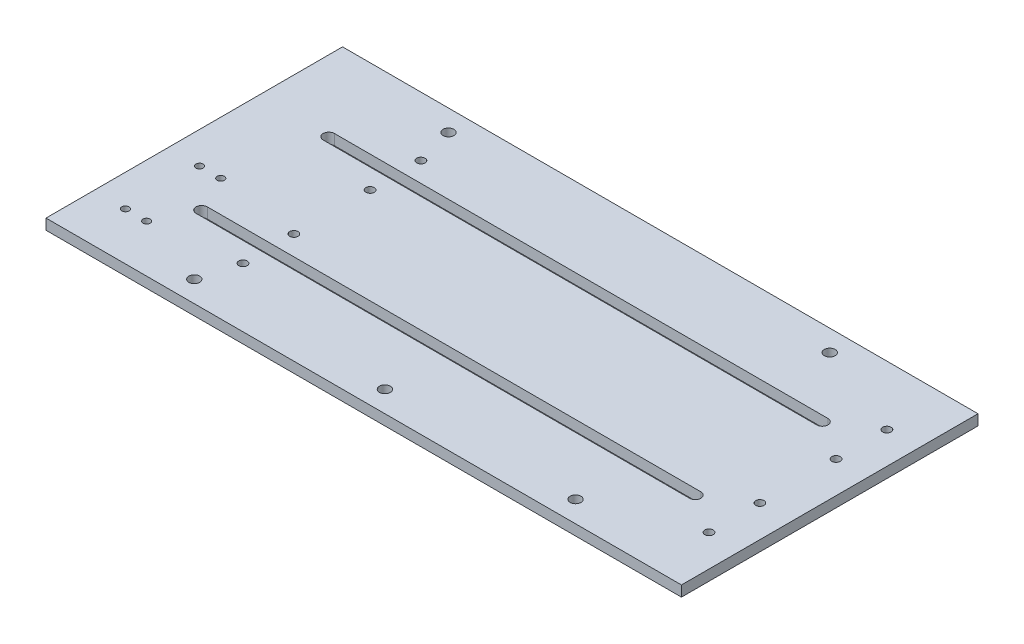
ISO-10303-21;
HEADER;
FILE_DESCRIPTION(('STEP AP214'),'2;1');
FILE_NAME('part.step','',(''),(''),'','','');
FILE_SCHEMA(('AUTOMOTIVE_DESIGN { 1 0 10303 214 1 1 1 1 }'));
ENDSEC;
DATA;
#1=APPLICATION_CONTEXT('core data for automotive mechanical design processes');
#2=APPLICATION_PROTOCOL_DEFINITION('international standard','automotive_design',2000,#1);
#3=PRODUCT_CONTEXT('',#1,'mechanical');
#4=PRODUCT('Part','Part','',(#3));
#5=PRODUCT_RELATED_PRODUCT_CATEGORY('part','',(#4));
#6=PRODUCT_DEFINITION_FORMATION('','',#4);
#7=PRODUCT_DEFINITION_CONTEXT('part definition',#1,'design');
#8=PRODUCT_DEFINITION('design','',#6,#7);
#9=PRODUCT_DEFINITION_SHAPE('','',#8);
#10=(LENGTH_UNIT() NAMED_UNIT(*) SI_UNIT(.MILLI.,.METRE.));
#11=(NAMED_UNIT(*) PLANE_ANGLE_UNIT() SI_UNIT($,.RADIAN.));
#12=(NAMED_UNIT(*) SI_UNIT($,.STERADIAN.) SOLID_ANGLE_UNIT());
#13=UNCERTAINTY_MEASURE_WITH_UNIT(LENGTH_MEASURE(1.E-05),#10,'distance_accuracy_value','');
#14=(GEOMETRIC_REPRESENTATION_CONTEXT(3) GLOBAL_UNCERTAINTY_ASSIGNED_CONTEXT((#13)) GLOBAL_UNIT_ASSIGNED_CONTEXT((#10,
#11,#12)) REPRESENTATION_CONTEXT('',''));
#15=CARTESIAN_POINT('',(0.,0.,0.));
#16=DIRECTION('',(0.,0.,1.));
#17=DIRECTION('',(1.,0.,0.));
#18=AXIS2_PLACEMENT_3D('',#15,#16,#17);
#19=CARTESIAN_POINT('',(-190.5,6.35,88.9));
#20=DIRECTION('',(1.,0.,0.));
#21=DIRECTION('',(0.,0.,-1.));
#22=AXIS2_PLACEMENT_3D('',#19,#20,#21);
#23=PLANE('',#22);
#24=DIRECTION('',(0.,0.,1.));
#25=VECTOR('',#24,1.);
#26=CARTESIAN_POINT('',(-190.5,0.,88.9));
#27=LINE('',#26,#25);
#28=CARTESIAN_POINT('',(-190.5,0.,-88.9));
#29=VERTEX_POINT('',#28);
#30=CARTESIAN_POINT('',(-190.5,0.,88.9));
#31=VERTEX_POINT('',#30);
#32=EDGE_CURVE('E365',#29,#31,#27,.T.);
#33=ORIENTED_EDGE('',*,*,#32,.T.);
#34=DIRECTION('',(0.,-1.,0.));
#35=VECTOR('',#34,1.);
#36=CARTESIAN_POINT('',(-190.5,6.35,88.9));
#37=LINE('',#36,#35);
#38=CARTESIAN_POINT('',(-190.5,6.35,88.9));
#39=VERTEX_POINT('',#38);
#40=EDGE_CURVE('E13',#39,#31,#37,.T.);
#41=ORIENTED_EDGE('',*,*,#40,.F.);
#42=DIRECTION('',(0.,0.,1.));
#43=VECTOR('',#42,1.);
#44=CARTESIAN_POINT('',(-190.5,6.35,88.9));
#45=LINE('',#44,#43);
#46=CARTESIAN_POINT('',(-190.5,6.35,-88.9));
#47=VERTEX_POINT('',#46);
#48=EDGE_CURVE('E366',#47,#39,#45,.T.);
#49=ORIENTED_EDGE('',*,*,#48,.F.);
#50=DIRECTION('',(0.,-1.,0.));
#51=VECTOR('',#50,1.);
#52=CARTESIAN_POINT('',(-190.5,6.35,-88.9));
#53=LINE('',#52,#51);
#54=EDGE_CURVE('E380',#47,#29,#53,.T.);
#55=ORIENTED_EDGE('',*,*,#54,.T.);
#56=EDGE_LOOP('',(#33,#41,#49,#55));
#57=FACE_BOUND('',#56,.T.);
#58=ADVANCED_FACE('F50',(#57),#23,.F.);
#59=CARTESIAN_POINT('',(-190.5,6.35,88.9));
#60=DIRECTION('',(0.,0.,-1.));
#61=DIRECTION('',(-1.,0.,0.));
#62=AXIS2_PLACEMENT_3D('',#59,#60,#61);
#63=PLANE('',#62);
#64=DIRECTION('',(1.,0.,0.));
#65=VECTOR('',#64,1.);
#66=CARTESIAN_POINT('',(-190.5,0.,88.9));
#67=LINE('',#66,#65);
#68=CARTESIAN_POINT('',(190.5,0.,88.9));
#69=VERTEX_POINT('',#68);
#70=EDGE_CURVE('E384',#31,#69,#67,.T.);
#71=ORIENTED_EDGE('',*,*,#70,.T.);
#72=DIRECTION('',(0.,-1.,0.));
#73=VECTOR('',#72,1.);
#74=CARTESIAN_POINT('',(190.5,6.35,88.9));
#75=LINE('',#74,#73);
#76=CARTESIAN_POINT('',(190.5,6.35,88.9));
#77=VERTEX_POINT('',#76);
#78=EDGE_CURVE('E58',#77,#69,#75,.T.);
#79=ORIENTED_EDGE('',*,*,#78,.F.);
#80=DIRECTION('',(1.,0.,0.));
#81=VECTOR('',#80,1.);
#82=CARTESIAN_POINT('',(-190.5,6.35,88.9));
#83=LINE('',#82,#81);
#84=EDGE_CURVE('E370',#39,#77,#83,.T.);
#85=ORIENTED_EDGE('',*,*,#84,.F.);
#86=ORIENTED_EDGE('',*,*,#40,.T.);
#87=EDGE_LOOP('',(#71,#79,#85,#86));
#88=FACE_BOUND('',#87,.T.);
#89=ADVANCED_FACE('F419',(#88),#63,.F.);
#90=CARTESIAN_POINT('',(190.5,6.35,88.9));
#91=DIRECTION('',(-1.,0.,0.));
#92=DIRECTION('',(0.,0.,1.));
#93=AXIS2_PLACEMENT_3D('',#90,#91,#92);
#94=PLANE('',#93);
#95=DIRECTION('',(0.,0.,-1.));
#96=VECTOR('',#95,1.);
#97=CARTESIAN_POINT('',(190.5,0.,88.9));
#98=LINE('',#97,#96);
#99=CARTESIAN_POINT('',(190.5,0.,-88.9));
#100=VERTEX_POINT('',#99);
#101=EDGE_CURVE('E387',#69,#100,#98,.T.);
#102=ORIENTED_EDGE('',*,*,#101,.T.);
#103=DIRECTION('',(0.,-1.,0.));
#104=VECTOR('',#103,1.);
#105=CARTESIAN_POINT('',(190.5,6.35,-88.9));
#106=LINE('',#105,#104);
#107=CARTESIAN_POINT('',(190.5,6.35,-88.9));
#108=VERTEX_POINT('',#107);
#109=EDGE_CURVE('E395',#108,#100,#106,.T.);
#110=ORIENTED_EDGE('',*,*,#109,.F.);
#111=DIRECTION('',(0.,0.,-1.));
#112=VECTOR('',#111,1.);
#113=CARTESIAN_POINT('',(190.5,6.35,88.9));
#114=LINE('',#113,#112);
#115=EDGE_CURVE('E374',#77,#108,#114,.T.);
#116=ORIENTED_EDGE('',*,*,#115,.F.);
#117=ORIENTED_EDGE('',*,*,#78,.T.);
#118=EDGE_LOOP('',(#102,#110,#116,#117));
#119=FACE_BOUND('',#118,.T.);
#120=ADVANCED_FACE('F404',(#119),#94,.F.);
#121=CARTESIAN_POINT('',(-190.5,6.35,-88.9));
#122=DIRECTION('',(0.,0.,1.));
#123=DIRECTION('',(1.,0.,0.));
#124=AXIS2_PLACEMENT_3D('',#121,#122,#123);
#125=PLANE('',#124);
#126=DIRECTION('',(-1.,0.,0.));
#127=VECTOR('',#126,1.);
#128=CARTESIAN_POINT('',(-190.5,0.,-88.9));
#129=LINE('',#128,#127);
#130=EDGE_CURVE('E371',#100,#29,#129,.T.);
#131=ORIENTED_EDGE('',*,*,#130,.T.);
#132=ORIENTED_EDGE('',*,*,#54,.F.);
#133=DIRECTION('',(-1.,0.,0.));
#134=VECTOR('',#133,1.);
#135=CARTESIAN_POINT('',(-190.5,6.35,-88.9));
#136=LINE('',#135,#134);
#137=EDGE_CURVE('E377',#108,#47,#136,.T.);
#138=ORIENTED_EDGE('',*,*,#137,.F.);
#139=ORIENTED_EDGE('',*,*,#109,.T.);
#140=EDGE_LOOP('',(#131,#132,#138,#139));
#141=FACE_BOUND('',#140,.T.);
#142=ADVANCED_FACE('F413',(#141),#125,.F.);
#143=CARTESIAN_POINT('',(0.,6.35,0.));
#144=DIRECTION('',(0.,-1.,0.));
#145=DIRECTION('',(0.,0.,-1.));
#146=AXIS2_PLACEMENT_3D('',#143,#144,#145);
#147=PLANE('',#146);
#148=DIRECTION('',(-1.,0.,0.));
#149=VECTOR('',#148,1.);
#150=CARTESIAN_POINT('',(0.,6.35,-41.4782));
#151=LINE('',#150,#149);
#152=CARTESIAN_POINT('',(147.955,6.35,-41.4782));
#153=VERTEX_POINT('',#152);
#154=CARTESIAN_POINT('',(-147.955,6.35,-41.4782));
#155=VERTEX_POINT('',#154);
#156=EDGE_CURVE('E143',#153,#155,#151,.T.);
#157=ORIENTED_EDGE('',*,*,#156,.F.);
#158=CARTESIAN_POINT('',(147.955,6.35,-38.1));
#159=DIRECTION('',(0.,1.,0.));
#160=DIRECTION('',(0.,0.,-1.));
#161=AXIS2_PLACEMENT_3D('',#158,#159,#160);
#162=CIRCLE('',#161,3.3782);
#163=CARTESIAN_POINT('',(147.955,6.35,-34.7218));
#164=VERTEX_POINT('',#163);
#165=EDGE_CURVE('E136',#164,#153,#162,.T.);
#166=ORIENTED_EDGE('',*,*,#165,.F.);
#167=DIRECTION('',(1.,0.,0.));
#168=VECTOR('',#167,1.);
#169=CARTESIAN_POINT('',(-147.955,6.35,-34.7218));
#170=LINE('',#169,#168);
#171=CARTESIAN_POINT('',(-147.955,6.35,-34.7218));
#172=VERTEX_POINT('',#171);
#173=EDGE_CURVE('E142',#172,#164,#170,.T.);
#174=ORIENTED_EDGE('',*,*,#173,.F.);
#175=CARTESIAN_POINT('',(-147.955,6.35,-38.1));
#176=DIRECTION('',(0.,1.,0.));
#177=DIRECTION('',(0.,0.,-1.));
#178=AXIS2_PLACEMENT_3D('',#175,#176,#177);
#179=CIRCLE('',#178,3.37820000000001);
#180=EDGE_CURVE('E152',#155,#172,#179,.T.);
#181=ORIENTED_EDGE('',*,*,#180,.F.);
#182=EDGE_LOOP('',(#157,#166,#174,#181));
#183=FACE_BOUND('',#182,.T.);
#184=CARTESIAN_POINT('',(147.955,6.35,38.1));
#185=DIRECTION('',(0.,-1.,0.));
#186=DIRECTION('',(0.,0.,1.));
#187=AXIS2_PLACEMENT_3D('',#184,#185,#186);
#188=CIRCLE('',#187,3.3782);
#189=CARTESIAN_POINT('',(147.955,6.35,34.7218));
#190=VERTEX_POINT('',#189);
#191=CARTESIAN_POINT('',(147.955,6.35,41.4782));
#192=VERTEX_POINT('',#191);
#193=EDGE_CURVE('E199',#190,#192,#188,.T.);
#194=ORIENTED_EDGE('',*,*,#193,.T.);
#195=DIRECTION('',(-1.,0.,0.));
#196=VECTOR('',#195,1.);
#197=CARTESIAN_POINT('',(0.,6.35,41.4782));
#198=LINE('',#197,#196);
#199=CARTESIAN_POINT('',(-147.955,6.35,41.4782));
#200=VERTEX_POINT('',#199);
#201=EDGE_CURVE('E186',#192,#200,#198,.T.);
#202=ORIENTED_EDGE('',*,*,#201,.T.);
#203=CARTESIAN_POINT('',(-147.955,6.35,38.1));
#204=DIRECTION('',(0.,-1.,0.));
#205=DIRECTION('',(0.,0.,1.));
#206=AXIS2_PLACEMENT_3D('',#203,#204,#205);
#207=CIRCLE('',#206,3.37820000000001);
#208=CARTESIAN_POINT('',(-147.955,6.35,34.7218));
#209=VERTEX_POINT('',#208);
#210=EDGE_CURVE('E190',#200,#209,#207,.T.);
#211=ORIENTED_EDGE('',*,*,#210,.T.);
#212=DIRECTION('',(1.,0.,0.));
#213=VECTOR('',#212,1.);
#214=CARTESIAN_POINT('',(-147.955,6.35,34.7218));
#215=LINE('',#214,#213);
#216=EDGE_CURVE('E195',#209,#190,#215,.T.);
#217=ORIENTED_EDGE('',*,*,#216,.T.);
#218=EDGE_LOOP('',(#194,#202,#211,#217));
#219=FACE_BOUND('',#218,.T.);
#220=CARTESIAN_POINT('',(-158.75,6.35,60.325));
#221=DIRECTION('',(0.,-1.,0.));
#222=DIRECTION('',(0.,0.,-1.));
#223=AXIS2_PLACEMENT_3D('',#220,#221,#222);
#224=CIRCLE('',#223,2.15265000000001);
#225=CARTESIAN_POINT('',(-158.75,6.35,58.17235));
#226=VERTEX_POINT('',#225);
#227=EDGE_CURVE('E242',#226,#226,#224,.F.);
#228=ORIENTED_EDGE('',*,*,#227,.F.);
#229=EDGE_LOOP('',(#228));
#230=FACE_BOUND('',#229,.T.);
#231=CARTESIAN_POINT('',(-171.45,6.35,15.875));
#232=DIRECTION('',(0.,-1.,0.));
#233=DIRECTION('',(0.,0.,-1.));
#234=AXIS2_PLACEMENT_3D('',#231,#232,#233);
#235=CIRCLE('',#234,2.15265000000001);
#236=CARTESIAN_POINT('',(-171.45,6.35,13.72235));
#237=VERTEX_POINT('',#236);
#238=EDGE_CURVE('E243',#237,#237,#235,.F.);
#239=ORIENTED_EDGE('',*,*,#238,.F.);
#240=EDGE_LOOP('',(#239));
#241=FACE_BOUND('',#240,.T.);
#242=CARTESIAN_POINT('',(-158.75,6.35,15.875));
#243=DIRECTION('',(0.,-1.,0.));
#244=DIRECTION('',(0.,0.,-1.));
#245=AXIS2_PLACEMENT_3D('',#242,#243,#244);
#246=CIRCLE('',#245,2.15265000000001);
#247=CARTESIAN_POINT('',(-158.75,6.35,13.72235));
#248=VERTEX_POINT('',#247);
#249=EDGE_CURVE('E233',#248,#248,#246,.F.);
#250=ORIENTED_EDGE('',*,*,#249,.F.);
#251=EDGE_LOOP('',(#250));
#252=FACE_BOUND('',#251,.T.);
#253=CARTESIAN_POINT('',(-171.45,6.35,60.325));
#254=DIRECTION('',(0.,-1.,0.));
#255=DIRECTION('',(0.,0.,-1.));
#256=AXIS2_PLACEMENT_3D('',#253,#254,#255);
#257=CIRCLE('',#256,2.15265000000001);
#258=CARTESIAN_POINT('',(-171.45,6.35,58.17235));
#259=VERTEX_POINT('',#258);
#260=EDGE_CURVE('E257',#259,#259,#257,.F.);
#261=ORIENTED_EDGE('',*,*,#260,.F.);
#262=EDGE_LOOP('',(#261));
#263=FACE_BOUND('',#262,.T.);
#264=CARTESIAN_POINT('',(-107.95,6.35,-22.86));
#265=DIRECTION('',(0.,-1.,0.));
#266=DIRECTION('',(0.,0.,-1.));
#267=AXIS2_PLACEMENT_3D('',#264,#265,#266);
#268=CIRCLE('',#267,2.5019);
#269=CARTESIAN_POINT('',(-107.95,6.35,-25.3619));
#270=VERTEX_POINT('',#269);
#271=EDGE_CURVE('E291',#270,#270,#268,.F.);
#272=ORIENTED_EDGE('',*,*,#271,.F.);
#273=EDGE_LOOP('',(#272));
#274=FACE_BOUND('',#273,.T.);
#275=CARTESIAN_POINT('',(171.45,6.35,-22.86));
#276=DIRECTION('',(0.,-1.,0.));
#277=DIRECTION('',(0.,0.,-1.));
#278=AXIS2_PLACEMENT_3D('',#275,#276,#277);
#279=CIRCLE('',#278,2.5019);
#280=CARTESIAN_POINT('',(171.45,6.35,-25.3619));
#281=VERTEX_POINT('',#280);
#282=EDGE_CURVE('E290',#281,#281,#279,.F.);
#283=ORIENTED_EDGE('',*,*,#282,.F.);
#284=EDGE_LOOP('',(#283));
#285=FACE_BOUND('',#284,.T.);
#286=CARTESIAN_POINT('',(171.45,6.35,-53.34));
#287=DIRECTION('',(0.,-1.,0.));
#288=DIRECTION('',(0.,0.,-1.));
#289=AXIS2_PLACEMENT_3D('',#286,#287,#288);
#290=CIRCLE('',#289,2.50190000000001);
#291=CARTESIAN_POINT('',(171.45,6.35,-55.8419));
#292=VERTEX_POINT('',#291);
#293=EDGE_CURVE('E307',#292,#292,#290,.F.);
#294=ORIENTED_EDGE('',*,*,#293,.F.);
#295=EDGE_LOOP('',(#294));
#296=FACE_BOUND('',#295,.T.);
#297=CARTESIAN_POINT('',(171.45,6.35,53.34));
#298=DIRECTION('',(0.,-1.,0.));
#299=DIRECTION('',(0.,0.,-1.));
#300=AXIS2_PLACEMENT_3D('',#297,#298,#299);
#301=CIRCLE('',#300,2.50190000000001);
#302=CARTESIAN_POINT('',(171.45,6.35,50.8381));
#303=VERTEX_POINT('',#302);
#304=EDGE_CURVE('E306',#303,#303,#301,.F.);
#305=ORIENTED_EDGE('',*,*,#304,.F.);
#306=EDGE_LOOP('',(#305));
#307=FACE_BOUND('',#306,.T.);
#308=CARTESIAN_POINT('',(-107.95,6.35,-53.34));
#309=DIRECTION('',(0.,-1.,0.));
#310=DIRECTION('',(0.,0.,-1.));
#311=AXIS2_PLACEMENT_3D('',#308,#309,#310);
#312=CIRCLE('',#311,2.50190000000001);
#313=CARTESIAN_POINT('',(-107.95,6.35,-55.8419));
#314=VERTEX_POINT('',#313);
#315=EDGE_CURVE('E266',#314,#314,#312,.F.);
#316=ORIENTED_EDGE('',*,*,#315,.F.);
#317=EDGE_LOOP('',(#316));
#318=FACE_BOUND('',#317,.T.);
#319=CARTESIAN_POINT('',(171.45,6.35,22.86));
#320=DIRECTION('',(0.,-1.,0.));
#321=DIRECTION('',(0.,0.,-1.));
#322=AXIS2_PLACEMENT_3D('',#319,#320,#321);
#323=CIRCLE('',#322,2.5019);
#324=CARTESIAN_POINT('',(171.45,6.35,20.3581));
#325=VERTEX_POINT('',#324);
#326=EDGE_CURVE('E267',#325,#325,#323,.F.);
#327=ORIENTED_EDGE('',*,*,#326,.F.);
#328=EDGE_LOOP('',(#327));
#329=FACE_BOUND('',#328,.T.);
#330=CARTESIAN_POINT('',(-107.95,6.35,53.34));
#331=DIRECTION('',(0.,-1.,0.));
#332=DIRECTION('',(0.,0.,-1.));
#333=AXIS2_PLACEMENT_3D('',#330,#331,#332);
#334=CIRCLE('',#333,2.50190000000001);
#335=CARTESIAN_POINT('',(-107.95,6.35,50.8381));
#336=VERTEX_POINT('',#335);
#337=EDGE_CURVE('E276',#336,#336,#334,.F.);
#338=ORIENTED_EDGE('',*,*,#337,.F.);
#339=EDGE_LOOP('',(#338));
#340=FACE_BOUND('',#339,.T.);
#341=CARTESIAN_POINT('',(-107.95,6.35,22.86));
#342=DIRECTION('',(0.,-1.,0.));
#343=DIRECTION('',(0.,0.,-1.));
#344=AXIS2_PLACEMENT_3D('',#341,#342,#343);
#345=CIRCLE('',#344,2.5019);
#346=CARTESIAN_POINT('',(-107.95,6.35,20.3581));
#347=VERTEX_POINT('',#346);
#348=EDGE_CURVE('E321',#347,#347,#345,.F.);
#349=ORIENTED_EDGE('',*,*,#348,.F.);
#350=EDGE_LOOP('',(#349));
#351=FACE_BOUND('',#350,.T.);
#352=CARTESIAN_POINT('',(114.3,6.35,-76.2));
#353=DIRECTION('',(0.,-1.,0.));
#354=DIRECTION('',(0.,0.,-1.));
#355=AXIS2_PLACEMENT_3D('',#352,#353,#354);
#356=CIRCLE('',#355,3.26389999999999);
#357=CARTESIAN_POINT('',(114.3,6.35,-79.4639));
#358=VERTEX_POINT('',#357);
#359=EDGE_CURVE('E348',#358,#358,#356,.F.);
#360=ORIENTED_EDGE('',*,*,#359,.F.);
#361=EDGE_LOOP('',(#360));
#362=FACE_BOUND('',#361,.T.);
#363=CARTESIAN_POINT('',(-114.3,6.35,-76.2));
#364=DIRECTION('',(0.,-1.,0.));
#365=DIRECTION('',(0.,0.,-1.));
#366=AXIS2_PLACEMENT_3D('',#363,#364,#365);
#367=CIRCLE('',#366,3.26389999999999);
#368=CARTESIAN_POINT('',(-114.3,6.35,-79.4639));
#369=VERTEX_POINT('',#368);
#370=EDGE_CURVE('E340',#369,#369,#367,.F.);
#371=ORIENTED_EDGE('',*,*,#370,.F.);
#372=EDGE_LOOP('',(#371));
#373=FACE_BOUND('',#372,.T.);
#374=CARTESIAN_POINT('',(114.3,6.35,76.2));
#375=DIRECTION('',(0.,-1.,0.));
#376=DIRECTION('',(0.,0.,-1.));
#377=AXIS2_PLACEMENT_3D('',#374,#375,#376);
#378=CIRCLE('',#377,3.26389999999999);
#379=CARTESIAN_POINT('',(114.3,6.35,72.9361));
#380=VERTEX_POINT('',#379);
#381=EDGE_CURVE('E331',#380,#380,#378,.F.);
#382=ORIENTED_EDGE('',*,*,#381,.F.);
#383=EDGE_LOOP('',(#382));
#384=FACE_BOUND('',#383,.T.);
#385=CARTESIAN_POINT('',(-114.3,6.35,76.2));
#386=DIRECTION('',(0.,-1.,0.));
#387=DIRECTION('',(0.,0.,-1.));
#388=AXIS2_PLACEMENT_3D('',#385,#386,#387);
#389=CIRCLE('',#388,3.26389999999999);
#390=CARTESIAN_POINT('',(-114.3,6.35,72.9361));
#391=VERTEX_POINT('',#390);
#392=EDGE_CURVE('E330',#391,#391,#389,.F.);
#393=ORIENTED_EDGE('',*,*,#392,.F.);
#394=EDGE_LOOP('',(#393));
#395=FACE_BOUND('',#394,.T.);
#396=CARTESIAN_POINT('',(0.,6.35,76.2));
#397=DIRECTION('',(0.,-1.,0.));
#398=DIRECTION('',(0.,0.,-1.));
#399=AXIS2_PLACEMENT_3D('',#396,#397,#398);
#400=CIRCLE('',#399,3.2639);
#401=CARTESIAN_POINT('',(0.,6.35,72.9361));
#402=VERTEX_POINT('',#401);
#403=EDGE_CURVE('E361',#402,#402,#400,.F.);
#404=ORIENTED_EDGE('',*,*,#403,.F.);
#405=EDGE_LOOP('',(#404));
#406=FACE_BOUND('',#405,.T.);
#407=ORIENTED_EDGE('',*,*,#48,.T.);
#408=ORIENTED_EDGE('',*,*,#84,.T.);
#409=ORIENTED_EDGE('',*,*,#115,.T.);
#410=ORIENTED_EDGE('',*,*,#137,.T.);
#411=EDGE_LOOP('',(#407,#408,#409,#410));
#412=FACE_BOUND('',#411,.T.);
#413=ADVANCED_FACE('F155',(#183,#219,#230,#241,#252,#263,#274,#285,#296,#307,#318,#329,#340,
#351,#362,#373,#384,#395,#406,#412),#147,.F.);
#414=CARTESIAN_POINT('',(0.,0.,0.));
#415=DIRECTION('',(0.,-1.,0.));
#416=DIRECTION('',(0.,0.,-1.));
#417=AXIS2_PLACEMENT_3D('',#414,#415,#416);
#418=PLANE('',#417);
#419=CARTESIAN_POINT('',(147.955,0.,-38.1));
#420=DIRECTION('',(0.,1.,0.));
#421=DIRECTION('',(0.,0.,-1.));
#422=AXIS2_PLACEMENT_3D('',#419,#420,#421);
#423=CIRCLE('',#422,3.3782);
#424=CARTESIAN_POINT('',(147.955,0.,-34.7218));
#425=VERTEX_POINT('',#424);
#426=CARTESIAN_POINT('',(147.955,0.,-41.4782));
#427=VERTEX_POINT('',#426);
#428=EDGE_CURVE('E167',#425,#427,#423,.T.);
#429=ORIENTED_EDGE('',*,*,#428,.T.);
#430=DIRECTION('',(-1.,0.,0.));
#431=VECTOR('',#430,1.);
#432=CARTESIAN_POINT('',(-25.4,0.,-41.4782));
#433=LINE('',#432,#431);
#434=CARTESIAN_POINT('',(-147.955,0.,-41.4782));
#435=VERTEX_POINT('',#434);
#436=EDGE_CURVE('E149',#427,#435,#433,.T.);
#437=ORIENTED_EDGE('',*,*,#436,.T.);
#438=CARTESIAN_POINT('',(-147.955,0.,-38.1));
#439=DIRECTION('',(0.,1.,0.));
#440=DIRECTION('',(0.,0.,-1.));
#441=AXIS2_PLACEMENT_3D('',#438,#439,#440);
#442=CIRCLE('',#441,3.37820000000001);
#443=CARTESIAN_POINT('',(-147.955,0.,-34.7218));
#444=VERTEX_POINT('',#443);
#445=EDGE_CURVE('E160',#435,#444,#442,.T.);
#446=ORIENTED_EDGE('',*,*,#445,.T.);
#447=DIRECTION('',(1.,0.,0.));
#448=VECTOR('',#447,1.);
#449=CARTESIAN_POINT('',(-147.955,0.,-34.7218));
#450=LINE('',#449,#448);
#451=EDGE_CURVE('E170',#444,#425,#450,.T.);
#452=ORIENTED_EDGE('',*,*,#451,.T.);
#453=EDGE_LOOP('',(#429,#437,#446,#452));
#454=FACE_BOUND('',#453,.T.);
#455=DIRECTION('',(-1.,0.,0.));
#456=VECTOR('',#455,1.);
#457=CARTESIAN_POINT('',(0.,0.,41.4782));
#458=LINE('',#457,#456);
#459=CARTESIAN_POINT('',(147.955,0.,41.4782));
#460=VERTEX_POINT('',#459);
#461=CARTESIAN_POINT('',(-147.955,0.,41.4782));
#462=VERTEX_POINT('',#461);
#463=EDGE_CURVE('E191',#460,#462,#458,.T.);
#464=ORIENTED_EDGE('',*,*,#463,.F.);
#465=CARTESIAN_POINT('',(147.955,0.,38.1));
#466=DIRECTION('',(0.,-1.,0.));
#467=DIRECTION('',(0.,0.,1.));
#468=AXIS2_PLACEMENT_3D('',#465,#466,#467);
#469=CIRCLE('',#468,3.3782);
#470=CARTESIAN_POINT('',(147.955,0.,34.7218));
#471=VERTEX_POINT('',#470);
#472=EDGE_CURVE('E211',#471,#460,#469,.T.);
#473=ORIENTED_EDGE('',*,*,#472,.F.);
#474=DIRECTION('',(1.,0.,0.));
#475=VECTOR('',#474,1.);
#476=CARTESIAN_POINT('',(-147.955,0.,34.7218));
#477=LINE('',#476,#475);
#478=CARTESIAN_POINT('',(-147.955,0.,34.7218));
#479=VERTEX_POINT('',#478);
#480=EDGE_CURVE('E207',#479,#471,#477,.T.);
#481=ORIENTED_EDGE('',*,*,#480,.F.);
#482=CARTESIAN_POINT('',(-147.955,0.,38.1));
#483=DIRECTION('',(0.,-1.,0.));
#484=DIRECTION('',(0.,0.,1.));
#485=AXIS2_PLACEMENT_3D('',#482,#483,#484);
#486=CIRCLE('',#485,3.37820000000001);
#487=EDGE_CURVE('E180',#462,#479,#486,.T.);
#488=ORIENTED_EDGE('',*,*,#487,.F.);
#489=EDGE_LOOP('',(#464,#473,#481,#488));
#490=FACE_BOUND('',#489,.T.);
#491=CARTESIAN_POINT('',(-158.75,0.,60.325));
#492=DIRECTION('',(0.,-1.,0.));
#493=DIRECTION('',(0.,0.,-1.));
#494=AXIS2_PLACEMENT_3D('',#491,#492,#493);
#495=CIRCLE('',#494,2.15265000000001);
#496=CARTESIAN_POINT('',(-158.75,0.,58.17235));
#497=VERTEX_POINT('',#496);
#498=EDGE_CURVE('E238',#497,#497,#495,.T.);
#499=ORIENTED_EDGE('',*,*,#498,.F.);
#500=EDGE_LOOP('',(#499));
#501=FACE_BOUND('',#500,.T.);
#502=CARTESIAN_POINT('',(-171.45,0.,15.875));
#503=DIRECTION('',(0.,-1.,0.));
#504=DIRECTION('',(0.,0.,-1.));
#505=AXIS2_PLACEMENT_3D('',#502,#503,#504);
#506=CIRCLE('',#505,2.15265000000001);
#507=CARTESIAN_POINT('',(-171.45,0.,13.72235));
#508=VERTEX_POINT('',#507);
#509=EDGE_CURVE('E237',#508,#508,#506,.T.);
#510=ORIENTED_EDGE('',*,*,#509,.F.);
#511=EDGE_LOOP('',(#510));
#512=FACE_BOUND('',#511,.T.);
#513=CARTESIAN_POINT('',(-158.75,0.,15.875));
#514=DIRECTION('',(0.,-1.,0.));
#515=DIRECTION('',(0.,0.,-1.));
#516=AXIS2_PLACEMENT_3D('',#513,#514,#515);
#517=CIRCLE('',#516,2.15265000000001);
#518=CARTESIAN_POINT('',(-158.75,0.,13.72235));
#519=VERTEX_POINT('',#518);
#520=EDGE_CURVE('E221',#519,#519,#517,.T.);
#521=ORIENTED_EDGE('',*,*,#520,.F.);
#522=EDGE_LOOP('',(#521));
#523=FACE_BOUND('',#522,.T.);
#524=CARTESIAN_POINT('',(-171.45,0.,60.325));
#525=DIRECTION('',(0.,-1.,0.));
#526=DIRECTION('',(0.,0.,-1.));
#527=AXIS2_PLACEMENT_3D('',#524,#525,#526);
#528=CIRCLE('',#527,2.15265000000001);
#529=CARTESIAN_POINT('',(-171.45,0.,58.17235));
#530=VERTEX_POINT('',#529);
#531=EDGE_CURVE('E247',#530,#530,#528,.T.);
#532=ORIENTED_EDGE('',*,*,#531,.F.);
#533=EDGE_LOOP('',(#532));
#534=FACE_BOUND('',#533,.T.);
#535=CARTESIAN_POINT('',(-107.95,0.,-22.86));
#536=DIRECTION('',(0.,-1.,0.));
#537=DIRECTION('',(0.,0.,1.));
#538=AXIS2_PLACEMENT_3D('',#535,#536,#537);
#539=CIRCLE('',#538,2.5019);
#540=CARTESIAN_POINT('',(-107.95,0.,-20.3581));
#541=VERTEX_POINT('',#540);
#542=EDGE_CURVE('E271',#541,#541,#539,.T.);
#543=ORIENTED_EDGE('',*,*,#542,.F.);
#544=EDGE_LOOP('',(#543));
#545=FACE_BOUND('',#544,.T.);
#546=CARTESIAN_POINT('',(171.45,0.,-22.86));
#547=DIRECTION('',(0.,-1.,0.));
#548=DIRECTION('',(0.,0.,1.));
#549=AXIS2_PLACEMENT_3D('',#546,#547,#548);
#550=CIRCLE('',#549,2.5019);
#551=CARTESIAN_POINT('',(171.45,0.,-20.3581));
#552=VERTEX_POINT('',#551);
#553=EDGE_CURVE('E286',#552,#552,#550,.T.);
#554=ORIENTED_EDGE('',*,*,#553,.F.);
#555=EDGE_LOOP('',(#554));
#556=FACE_BOUND('',#555,.T.);
#557=CARTESIAN_POINT('',(171.45,0.,-53.34));
#558=DIRECTION('',(0.,-1.,0.));
#559=DIRECTION('',(0.,0.,1.));
#560=AXIS2_PLACEMENT_3D('',#557,#558,#559);
#561=CIRCLE('',#560,2.50190000000001);
#562=CARTESIAN_POINT('',(171.45,0.,-50.8381));
#563=VERTEX_POINT('',#562);
#564=EDGE_CURVE('E295',#563,#563,#561,.T.);
#565=ORIENTED_EDGE('',*,*,#564,.F.);
#566=EDGE_LOOP('',(#565));
#567=FACE_BOUND('',#566,.T.);
#568=CARTESIAN_POINT('',(171.45,0.,53.34));
#569=DIRECTION('',(0.,-1.,0.));
#570=DIRECTION('',(0.,0.,-1.));
#571=AXIS2_PLACEMENT_3D('',#568,#569,#570);
#572=CIRCLE('',#571,2.50190000000001);
#573=CARTESIAN_POINT('',(171.45,0.,50.8381));
#574=VERTEX_POINT('',#573);
#575=EDGE_CURVE('E302',#574,#574,#572,.T.);
#576=ORIENTED_EDGE('',*,*,#575,.F.);
#577=EDGE_LOOP('',(#576));
#578=FACE_BOUND('',#577,.T.);
#579=CARTESIAN_POINT('',(-107.95,0.,-53.34));
#580=DIRECTION('',(0.,-1.,0.));
#581=DIRECTION('',(0.,0.,-1.));
#582=AXIS2_PLACEMENT_3D('',#579,#580,#581);
#583=CIRCLE('',#582,2.50190000000001);
#584=CARTESIAN_POINT('',(-107.95,0.,-55.8419));
#585=VERTEX_POINT('',#584);
#586=EDGE_CURVE('E262',#585,#585,#583,.T.);
#587=ORIENTED_EDGE('',*,*,#586,.F.);
#588=EDGE_LOOP('',(#587));
#589=FACE_BOUND('',#588,.T.);
#590=CARTESIAN_POINT('',(171.45,0.,22.86));
#591=DIRECTION('',(0.,-1.,0.));
#592=DIRECTION('',(0.,0.,-1.));
#593=AXIS2_PLACEMENT_3D('',#590,#591,#592);
#594=CIRCLE('',#593,2.5019);
#595=CARTESIAN_POINT('',(171.45,0.,20.3581));
#596=VERTEX_POINT('',#595);
#597=EDGE_CURVE('E272',#596,#596,#594,.T.);
#598=ORIENTED_EDGE('',*,*,#597,.F.);
#599=EDGE_LOOP('',(#598));
#600=FACE_BOUND('',#599,.T.);
#601=CARTESIAN_POINT('',(-107.95,0.,53.34));
#602=DIRECTION('',(0.,-1.,0.));
#603=DIRECTION('',(0.,0.,1.));
#604=AXIS2_PLACEMENT_3D('',#601,#602,#603);
#605=CIRCLE('',#604,2.50190000000001);
#606=CARTESIAN_POINT('',(-107.95,0.,55.8419));
#607=VERTEX_POINT('',#606);
#608=EDGE_CURVE('E261',#607,#607,#605,.T.);
#609=ORIENTED_EDGE('',*,*,#608,.F.);
#610=EDGE_LOOP('',(#609));
#611=FACE_BOUND('',#610,.T.);
#612=CARTESIAN_POINT('',(-107.95,0.,22.86));
#613=DIRECTION('',(0.,-1.,0.));
#614=DIRECTION('',(0.,0.,-1.));
#615=AXIS2_PLACEMENT_3D('',#612,#613,#614);
#616=CIRCLE('',#615,2.5019);
#617=CARTESIAN_POINT('',(-107.95,0.,20.3581));
#618=VERTEX_POINT('',#617);
#619=EDGE_CURVE('E311',#618,#618,#616,.T.);
#620=ORIENTED_EDGE('',*,*,#619,.F.);
#621=EDGE_LOOP('',(#620));
#622=FACE_BOUND('',#621,.T.);
#623=CARTESIAN_POINT('',(114.3,0.,-76.2));
#624=DIRECTION('',(0.,-1.,0.));
#625=DIRECTION('',(0.,0.,-1.));
#626=AXIS2_PLACEMENT_3D('',#623,#624,#625);
#627=CIRCLE('',#626,3.26389999999999);
#628=CARTESIAN_POINT('',(114.3,0.,-79.4639));
#629=VERTEX_POINT('',#628);
#630=EDGE_CURVE('E325',#629,#629,#627,.T.);
#631=ORIENTED_EDGE('',*,*,#630,.F.);
#632=EDGE_LOOP('',(#631));
#633=FACE_BOUND('',#632,.T.);
#634=CARTESIAN_POINT('',(-114.3,0.,-76.2));
#635=DIRECTION('',(0.,-1.,0.));
#636=DIRECTION('',(0.,0.,-1.));
#637=AXIS2_PLACEMENT_3D('',#634,#635,#636);
#638=CIRCLE('',#637,3.26389999999999);
#639=CARTESIAN_POINT('',(-114.3,0.,-79.4639));
#640=VERTEX_POINT('',#639);
#641=EDGE_CURVE('E344',#640,#640,#638,.T.);
#642=ORIENTED_EDGE('',*,*,#641,.F.);
#643=EDGE_LOOP('',(#642));
#644=FACE_BOUND('',#643,.T.);
#645=CARTESIAN_POINT('',(114.3,0.,76.2));
#646=DIRECTION('',(0.,-1.,0.));
#647=DIRECTION('',(0.,0.,-1.));
#648=AXIS2_PLACEMENT_3D('',#645,#646,#647);
#649=CIRCLE('',#648,3.26389999999999);
#650=CARTESIAN_POINT('',(114.3,0.,72.9361));
#651=VERTEX_POINT('',#650);
#652=EDGE_CURVE('E336',#651,#651,#649,.T.);
#653=ORIENTED_EDGE('',*,*,#652,.F.);
#654=EDGE_LOOP('',(#653));
#655=FACE_BOUND('',#654,.T.);
#656=CARTESIAN_POINT('',(-114.3,0.,76.2));
#657=DIRECTION('',(0.,-1.,0.));
#658=DIRECTION('',(0.,0.,-1.));
#659=AXIS2_PLACEMENT_3D('',#656,#657,#658);
#660=CIRCLE('',#659,3.26389999999999);
#661=CARTESIAN_POINT('',(-114.3,0.,72.9361));
#662=VERTEX_POINT('',#661);
#663=EDGE_CURVE('E326',#662,#662,#660,.T.);
#664=ORIENTED_EDGE('',*,*,#663,.F.);
#665=EDGE_LOOP('',(#664));
#666=FACE_BOUND('',#665,.T.);
#667=CARTESIAN_POINT('',(0.,0.,76.2));
#668=DIRECTION('',(0.,-1.,0.));
#669=DIRECTION('',(0.,0.,-1.));
#670=AXIS2_PLACEMENT_3D('',#667,#668,#669);
#671=CIRCLE('',#670,3.2639);
#672=CARTESIAN_POINT('',(0.,0.,72.9361));
#673=VERTEX_POINT('',#672);
#674=EDGE_CURVE('E335',#673,#673,#671,.T.);
#675=ORIENTED_EDGE('',*,*,#674,.F.);
#676=EDGE_LOOP('',(#675));
#677=FACE_BOUND('',#676,.T.);
#678=ORIENTED_EDGE('',*,*,#32,.F.);
#679=ORIENTED_EDGE('',*,*,#130,.F.);
#680=ORIENTED_EDGE('',*,*,#101,.F.);
#681=ORIENTED_EDGE('',*,*,#70,.F.);
#682=EDGE_LOOP('',(#678,#679,#680,#681));
#683=FACE_BOUND('',#682,.T.);
#684=ADVANCED_FACE('F410',(#454,#490,#501,#512,#523,#534,#545,#556,#567,#578,#589,#600,#611,
#622,#633,#644,#655,#666,#677,#683),#418,.T.);
#685=CARTESIAN_POINT('',(0.,15.5817032924591,76.2));
#686=DIRECTION('',(0.,-1.,0.));
#687=DIRECTION('',(0.,0.,-1.));
#688=AXIS2_PLACEMENT_3D('',#685,#686,#687);
#689=CYLINDRICAL_SURFACE('',#688,3.2639);
#690=ORIENTED_EDGE('',*,*,#403,.T.);
#691=EDGE_LOOP('',(#690));
#692=FACE_BOUND('',#691,.T.);
#693=ORIENTED_EDGE('',*,*,#674,.T.);
#694=EDGE_LOOP('',(#693));
#695=FACE_BOUND('',#694,.T.);
#696=ADVANCED_FACE('F431',(#692,#695),#689,.F.);
#697=CARTESIAN_POINT('',(-114.3,15.5817032924591,76.2));
#698=DIRECTION('',(0.,-1.,0.));
#699=DIRECTION('',(0.,0.,-1.));
#700=AXIS2_PLACEMENT_3D('',#697,#698,#699);
#701=CYLINDRICAL_SURFACE('',#700,3.26389999999999);
#702=ORIENTED_EDGE('',*,*,#392,.T.);
#703=EDGE_LOOP('',(#702));
#704=FACE_BOUND('',#703,.T.);
#705=ORIENTED_EDGE('',*,*,#663,.T.);
#706=EDGE_LOOP('',(#705));
#707=FACE_BOUND('',#706,.T.);
#708=ADVANCED_FACE('F437',(#704,#707),#701,.F.);
#709=CARTESIAN_POINT('',(114.3,15.5817032924591,76.2));
#710=DIRECTION('',(0.,-1.,0.));
#711=DIRECTION('',(0.,0.,-1.));
#712=AXIS2_PLACEMENT_3D('',#709,#710,#711);
#713=CYLINDRICAL_SURFACE('',#712,3.26389999999999);
#714=ORIENTED_EDGE('',*,*,#381,.T.);
#715=EDGE_LOOP('',(#714));
#716=FACE_BOUND('',#715,.T.);
#717=ORIENTED_EDGE('',*,*,#652,.T.);
#718=EDGE_LOOP('',(#717));
#719=FACE_BOUND('',#718,.T.);
#720=ADVANCED_FACE('F447',(#716,#719),#713,.F.);
#721=CARTESIAN_POINT('',(-114.3,15.5817032924591,-76.2));
#722=DIRECTION('',(0.,-1.,0.));
#723=DIRECTION('',(0.,0.,-1.));
#724=AXIS2_PLACEMENT_3D('',#721,#722,#723);
#725=CYLINDRICAL_SURFACE('',#724,3.26389999999999);
#726=ORIENTED_EDGE('',*,*,#370,.T.);
#727=EDGE_LOOP('',(#726));
#728=FACE_BOUND('',#727,.T.);
#729=ORIENTED_EDGE('',*,*,#641,.T.);
#730=EDGE_LOOP('',(#729));
#731=FACE_BOUND('',#730,.T.);
#732=ADVANCED_FACE('F443',(#728,#731),#725,.F.);
#733=CARTESIAN_POINT('',(114.3,15.5817032924591,-76.2));
#734=DIRECTION('',(0.,-1.,0.));
#735=DIRECTION('',(0.,0.,-1.));
#736=AXIS2_PLACEMENT_3D('',#733,#734,#735);
#737=CYLINDRICAL_SURFACE('',#736,3.26389999999999);
#738=ORIENTED_EDGE('',*,*,#359,.T.);
#739=EDGE_LOOP('',(#738));
#740=FACE_BOUND('',#739,.T.);
#741=ORIENTED_EDGE('',*,*,#630,.T.);
#742=EDGE_LOOP('',(#741));
#743=FACE_BOUND('',#742,.T.);
#744=ADVANCED_FACE('F439',(#740,#743),#737,.F.);
#745=CARTESIAN_POINT('',(-107.95,13.4264418234025,22.86));
#746=DIRECTION('',(0.,-1.,0.));
#747=DIRECTION('',(0.,0.,-1.));
#748=AXIS2_PLACEMENT_3D('',#745,#746,#747);
#749=CYLINDRICAL_SURFACE('',#748,2.5019);
#750=ORIENTED_EDGE('',*,*,#348,.T.);
#751=EDGE_LOOP('',(#750));
#752=FACE_BOUND('',#751,.T.);
#753=ORIENTED_EDGE('',*,*,#619,.T.);
#754=EDGE_LOOP('',(#753));
#755=FACE_BOUND('',#754,.T.);
#756=ADVANCED_FACE('F442',(#752,#755),#749,.F.);
#757=CARTESIAN_POINT('',(-107.95,13.4264418234025,53.34));
#758=DIRECTION('',(0.,-1.,0.));
#759=DIRECTION('',(0.,0.,-1.));
#760=AXIS2_PLACEMENT_3D('',#757,#758,#759);
#761=CYLINDRICAL_SURFACE('',#760,2.50190000000001);
#762=ORIENTED_EDGE('',*,*,#337,.T.);
#763=EDGE_LOOP('',(#762));
#764=FACE_BOUND('',#763,.T.);
#765=ORIENTED_EDGE('',*,*,#608,.T.);
#766=EDGE_LOOP('',(#765));
#767=FACE_BOUND('',#766,.T.);
#768=ADVANCED_FACE('F457',(#764,#767),#761,.F.);
#769=CARTESIAN_POINT('',(171.45,13.4264418234025,22.86));
#770=DIRECTION('',(0.,-1.,0.));
#771=DIRECTION('',(0.,0.,-1.));
#772=AXIS2_PLACEMENT_3D('',#769,#770,#771);
#773=CYLINDRICAL_SURFACE('',#772,2.5019);
#774=ORIENTED_EDGE('',*,*,#326,.T.);
#775=EDGE_LOOP('',(#774));
#776=FACE_BOUND('',#775,.T.);
#777=ORIENTED_EDGE('',*,*,#597,.T.);
#778=EDGE_LOOP('',(#777));
#779=FACE_BOUND('',#778,.T.);
#780=ADVANCED_FACE('F479',(#776,#779),#773,.F.);
#781=CARTESIAN_POINT('',(-107.95,13.4264418234025,-53.34));
#782=DIRECTION('',(0.,-1.,0.));
#783=DIRECTION('',(0.,0.,-1.));
#784=AXIS2_PLACEMENT_3D('',#781,#782,#783);
#785=CYLINDRICAL_SURFACE('',#784,2.50190000000001);
#786=ORIENTED_EDGE('',*,*,#315,.T.);
#787=EDGE_LOOP('',(#786));
#788=FACE_BOUND('',#787,.T.);
#789=ORIENTED_EDGE('',*,*,#586,.T.);
#790=EDGE_LOOP('',(#789));
#791=FACE_BOUND('',#790,.T.);
#792=ADVANCED_FACE('F467',(#788,#791),#785,.F.);
#793=CARTESIAN_POINT('',(171.45,13.4264418234025,53.34));
#794=DIRECTION('',(0.,-1.,0.));
#795=DIRECTION('',(0.,0.,-1.));
#796=AXIS2_PLACEMENT_3D('',#793,#794,#795);
#797=CYLINDRICAL_SURFACE('',#796,2.50190000000001);
#798=ORIENTED_EDGE('',*,*,#304,.T.);
#799=EDGE_LOOP('',(#798));
#800=FACE_BOUND('',#799,.T.);
#801=ORIENTED_EDGE('',*,*,#575,.T.);
#802=EDGE_LOOP('',(#801));
#803=FACE_BOUND('',#802,.T.);
#804=ADVANCED_FACE('F463',(#800,#803),#797,.F.);
#805=CARTESIAN_POINT('',(171.45,13.4264418234025,-53.34));
#806=DIRECTION('',(0.,-1.,0.));
#807=DIRECTION('',(0.,0.,-1.));
#808=AXIS2_PLACEMENT_3D('',#805,#806,#807);
#809=CYLINDRICAL_SURFACE('',#808,2.50190000000001);
#810=ORIENTED_EDGE('',*,*,#293,.T.);
#811=EDGE_LOOP('',(#810));
#812=FACE_BOUND('',#811,.T.);
#813=ORIENTED_EDGE('',*,*,#564,.T.);
#814=EDGE_LOOP('',(#813));
#815=FACE_BOUND('',#814,.T.);
#816=ADVANCED_FACE('F459',(#812,#815),#809,.F.);
#817=CARTESIAN_POINT('',(171.45,13.4264418234025,-22.86));
#818=DIRECTION('',(0.,-1.,0.));
#819=DIRECTION('',(0.,0.,-1.));
#820=AXIS2_PLACEMENT_3D('',#817,#818,#819);
#821=CYLINDRICAL_SURFACE('',#820,2.5019);
#822=ORIENTED_EDGE('',*,*,#282,.T.);
#823=EDGE_LOOP('',(#822));
#824=FACE_BOUND('',#823,.T.);
#825=ORIENTED_EDGE('',*,*,#553,.T.);
#826=EDGE_LOOP('',(#825));
#827=FACE_BOUND('',#826,.T.);
#828=ADVANCED_FACE('F462',(#824,#827),#821,.F.);
#829=CARTESIAN_POINT('',(-107.95,13.4264418234025,-22.86));
#830=DIRECTION('',(0.,-1.,0.));
#831=DIRECTION('',(0.,0.,-1.));
#832=AXIS2_PLACEMENT_3D('',#829,#830,#831);
#833=CYLINDRICAL_SURFACE('',#832,2.5019);
#834=ORIENTED_EDGE('',*,*,#271,.T.);
#835=EDGE_LOOP('',(#834));
#836=FACE_BOUND('',#835,.T.);
#837=ORIENTED_EDGE('',*,*,#542,.T.);
#838=EDGE_LOOP('',(#837));
#839=FACE_BOUND('',#838,.T.);
#840=ADVANCED_FACE('F469',(#836,#839),#833,.F.);
#841=CARTESIAN_POINT('',(-171.45,12.4386136500849,60.325));
#842=DIRECTION('',(0.,-1.,0.));
#843=DIRECTION('',(0.,0.,-1.));
#844=AXIS2_PLACEMENT_3D('',#841,#842,#843);
#845=CYLINDRICAL_SURFACE('',#844,2.15265000000001);
#846=ORIENTED_EDGE('',*,*,#260,.T.);
#847=EDGE_LOOP('',(#846));
#848=FACE_BOUND('',#847,.T.);
#849=ORIENTED_EDGE('',*,*,#531,.T.);
#850=EDGE_LOOP('',(#849));
#851=FACE_BOUND('',#850,.T.);
#852=ADVANCED_FACE('F472',(#848,#851),#845,.F.);
#853=CARTESIAN_POINT('',(-158.75,12.4386136500849,15.875));
#854=DIRECTION('',(0.,-1.,0.));
#855=DIRECTION('',(0.,0.,-1.));
#856=AXIS2_PLACEMENT_3D('',#853,#854,#855);
#857=CYLINDRICAL_SURFACE('',#856,2.15265000000001);
#858=ORIENTED_EDGE('',*,*,#249,.T.);
#859=EDGE_LOOP('',(#858));
#860=FACE_BOUND('',#859,.T.);
#861=ORIENTED_EDGE('',*,*,#520,.T.);
#862=EDGE_LOOP('',(#861));
#863=FACE_BOUND('',#862,.T.);
#864=ADVANCED_FACE('F489',(#860,#863),#857,.F.);
#865=CARTESIAN_POINT('',(-171.45,12.4386136500849,15.875));
#866=DIRECTION('',(0.,-1.,0.));
#867=DIRECTION('',(0.,0.,-1.));
#868=AXIS2_PLACEMENT_3D('',#865,#866,#867);
#869=CYLINDRICAL_SURFACE('',#868,2.15265000000001);
#870=ORIENTED_EDGE('',*,*,#238,.T.);
#871=EDGE_LOOP('',(#870));
#872=FACE_BOUND('',#871,.T.);
#873=ORIENTED_EDGE('',*,*,#509,.T.);
#874=EDGE_LOOP('',(#873));
#875=FACE_BOUND('',#874,.T.);
#876=ADVANCED_FACE('F491',(#872,#875),#869,.F.);
#877=CARTESIAN_POINT('',(-158.75,12.4386136500849,60.325));
#878=DIRECTION('',(0.,-1.,0.));
#879=DIRECTION('',(0.,0.,-1.));
#880=AXIS2_PLACEMENT_3D('',#877,#878,#879);
#881=CYLINDRICAL_SURFACE('',#880,2.15265000000001);
#882=ORIENTED_EDGE('',*,*,#227,.T.);
#883=EDGE_LOOP('',(#882));
#884=FACE_BOUND('',#883,.T.);
#885=ORIENTED_EDGE('',*,*,#498,.T.);
#886=EDGE_LOOP('',(#885));
#887=FACE_BOUND('',#886,.T.);
#888=ADVANCED_FACE('F494',(#884,#887),#881,.F.);
#889=CARTESIAN_POINT('',(0.,6.35,41.4782));
#890=DIRECTION('',(0.,0.,1.));
#891=DIRECTION('',(1.,0.,0.));
#892=AXIS2_PLACEMENT_3D('',#889,#890,#891);
#893=PLANE('',#892);
#894=ORIENTED_EDGE('',*,*,#463,.T.);
#895=DIRECTION('',(0.,-1.,0.));
#896=VECTOR('',#895,1.);
#897=CARTESIAN_POINT('',(-147.955,6.35,41.4782));
#898=LINE('',#897,#896);
#899=EDGE_CURVE('E203',#200,#462,#898,.T.);
#900=ORIENTED_EDGE('',*,*,#899,.F.);
#901=ORIENTED_EDGE('',*,*,#201,.F.);
#902=DIRECTION('',(0.,-1.,0.));
#903=VECTOR('',#902,1.);
#904=CARTESIAN_POINT('',(147.955,6.35,41.4782));
#905=LINE('',#904,#903);
#906=EDGE_CURVE('E218',#192,#460,#905,.T.);
#907=ORIENTED_EDGE('',*,*,#906,.T.);
#908=EDGE_LOOP('',(#894,#900,#901,#907));
#909=FACE_BOUND('',#908,.T.);
#910=ADVANCED_FACE('F498',(#909),#893,.F.);
#911=CARTESIAN_POINT('',(147.955,6.35,38.1));
#912=DIRECTION('',(0.,-1.,0.));
#913=DIRECTION('',(0.,0.,-1.));
#914=AXIS2_PLACEMENT_3D('',#911,#912,#913);
#915=CYLINDRICAL_SURFACE('',#914,3.3782);
#916=ORIENTED_EDGE('',*,*,#472,.T.);
#917=ORIENTED_EDGE('',*,*,#906,.F.);
#918=ORIENTED_EDGE('',*,*,#193,.F.);
#919=DIRECTION('',(0.,-1.,0.));
#920=VECTOR('',#919,1.);
#921=CARTESIAN_POINT('',(147.955,6.35,34.7218));
#922=LINE('',#921,#920);
#923=EDGE_CURVE('E222',#190,#471,#922,.T.);
#924=ORIENTED_EDGE('',*,*,#923,.T.);
#925=EDGE_LOOP('',(#916,#917,#918,#924));
#926=FACE_BOUND('',#925,.T.);
#927=ADVANCED_FACE('F510',(#926),#915,.F.);
#928=CARTESIAN_POINT('',(-147.955,6.35,34.7218));
#929=DIRECTION('',(0.,0.,-1.));
#930=DIRECTION('',(-1.,0.,0.));
#931=AXIS2_PLACEMENT_3D('',#928,#929,#930);
#932=PLANE('',#931);
#933=ORIENTED_EDGE('',*,*,#480,.T.);
#934=ORIENTED_EDGE('',*,*,#923,.F.);
#935=ORIENTED_EDGE('',*,*,#216,.F.);
#936=DIRECTION('',(0.,-1.,0.));
#937=VECTOR('',#936,1.);
#938=CARTESIAN_POINT('',(-147.955,6.35,34.7218));
#939=LINE('',#938,#937);
#940=EDGE_CURVE('E225',#209,#479,#939,.T.);
#941=ORIENTED_EDGE('',*,*,#940,.T.);
#942=EDGE_LOOP('',(#933,#934,#935,#941));
#943=FACE_BOUND('',#942,.T.);
#944=ADVANCED_FACE('F506',(#943),#932,.F.);
#945=CARTESIAN_POINT('',(-147.955,6.35,38.1));
#946=DIRECTION('',(0.,-1.,0.));
#947=DIRECTION('',(0.,0.,-1.));
#948=AXIS2_PLACEMENT_3D('',#945,#946,#947);
#949=CYLINDRICAL_SURFACE('',#948,3.37820000000001);
#950=ORIENTED_EDGE('',*,*,#487,.T.);
#951=ORIENTED_EDGE('',*,*,#940,.F.);
#952=ORIENTED_EDGE('',*,*,#210,.F.);
#953=ORIENTED_EDGE('',*,*,#899,.T.);
#954=EDGE_LOOP('',(#950,#951,#952,#953));
#955=FACE_BOUND('',#954,.T.);
#956=ADVANCED_FACE('F503',(#955),#949,.F.);
#957=CARTESIAN_POINT('',(-25.4,6.35,-41.4782));
#958=DIRECTION('',(0.,0.,1.));
#959=DIRECTION('',(1.,0.,0.));
#960=AXIS2_PLACEMENT_3D('',#957,#958,#959);
#961=PLANE('',#960);
#962=ORIENTED_EDGE('',*,*,#436,.F.);
#963=DIRECTION('',(0.,-1.,0.));
#964=VECTOR('',#963,1.);
#965=CARTESIAN_POINT('',(147.955,6.35,-41.4782));
#966=LINE('',#965,#964);
#967=EDGE_CURVE('E70',#153,#427,#966,.T.);
#968=ORIENTED_EDGE('',*,*,#967,.F.);
#969=ORIENTED_EDGE('',*,*,#156,.T.);
#970=DIRECTION('',(0.,-1.,0.));
#971=VECTOR('',#970,1.);
#972=CARTESIAN_POINT('',(-147.955,6.35,-41.4782));
#973=LINE('',#972,#971);
#974=EDGE_CURVE('E177',#155,#435,#973,.T.);
#975=ORIENTED_EDGE('',*,*,#974,.T.);
#976=EDGE_LOOP('',(#962,#968,#969,#975));
#977=FACE_BOUND('',#976,.T.);
#978=ADVANCED_FACE('F146',(#977),#961,.T.);
#979=CARTESIAN_POINT('',(-147.955,6.35,-38.1));
#980=DIRECTION('',(0.,-1.,0.));
#981=DIRECTION('',(0.,0.,-1.));
#982=AXIS2_PLACEMENT_3D('',#979,#980,#981);
#983=CYLINDRICAL_SURFACE('',#982,3.37820000000001);
#984=ORIENTED_EDGE('',*,*,#445,.F.);
#985=ORIENTED_EDGE('',*,*,#974,.F.);
#986=ORIENTED_EDGE('',*,*,#180,.T.);
#987=DIRECTION('',(0.,-1.,0.));
#988=VECTOR('',#987,1.);
#989=CARTESIAN_POINT('',(-147.955,6.35,-34.7218));
#990=LINE('',#989,#988);
#991=EDGE_CURVE('E181',#172,#444,#990,.T.);
#992=ORIENTED_EDGE('',*,*,#991,.T.);
#993=EDGE_LOOP('',(#984,#985,#986,#992));
#994=FACE_BOUND('',#993,.T.);
#995=ADVANCED_FACE('F523',(#994),#983,.F.);
#996=CARTESIAN_POINT('',(-147.955,6.35,-34.7218));
#997=DIRECTION('',(0.,0.,-1.));
#998=DIRECTION('',(-1.,0.,0.));
#999=AXIS2_PLACEMENT_3D('',#996,#997,#998);
#1000=PLANE('',#999);
#1001=ORIENTED_EDGE('',*,*,#451,.F.);
#1002=ORIENTED_EDGE('',*,*,#991,.F.);
#1003=ORIENTED_EDGE('',*,*,#173,.T.);
#1004=DIRECTION('',(0.,-1.,0.));
#1005=VECTOR('',#1004,1.);
#1006=CARTESIAN_POINT('',(147.955,6.35,-34.7218));
#1007=LINE('',#1006,#1005);
#1008=EDGE_CURVE('E65',#164,#425,#1007,.T.);
#1009=ORIENTED_EDGE('',*,*,#1008,.T.);
#1010=EDGE_LOOP('',(#1001,#1002,#1003,#1009));
#1011=FACE_BOUND('',#1010,.T.);
#1012=ADVANCED_FACE('F520',(#1011),#1000,.T.);
#1013=CARTESIAN_POINT('',(147.955,6.35,-38.1));
#1014=DIRECTION('',(0.,-1.,0.));
#1015=DIRECTION('',(0.,0.,-1.));
#1016=AXIS2_PLACEMENT_3D('',#1013,#1014,#1015);
#1017=CYLINDRICAL_SURFACE('',#1016,3.3782);
#1018=ORIENTED_EDGE('',*,*,#428,.F.);
#1019=ORIENTED_EDGE('',*,*,#1008,.F.);
#1020=ORIENTED_EDGE('',*,*,#165,.T.);
#1021=ORIENTED_EDGE('',*,*,#967,.T.);
#1022=EDGE_LOOP('',(#1018,#1019,#1020,#1021));
#1023=FACE_BOUND('',#1022,.T.);
#1024=ADVANCED_FACE('F137',(#1023),#1017,.F.);
#1025=CLOSED_SHELL('',(#58,#89,#120,#142,#413,#684,#696,#708,#720,#732,#744,#756,#768,#780,#792,
#804,#816,#828,#840,#852,#864,#876,#888,#910,#927,#944,#956,#978,#995,#1012,#1024));
#1026=MANIFOLD_SOLID_BREP('B2',#1025);
#1027=ADVANCED_BREP_SHAPE_REPRESENTATION('',(#18,#1026),#14);
#1028=SHAPE_DEFINITION_REPRESENTATION(#9,#1027);
ENDSEC;
END-ISO-10303-21;
